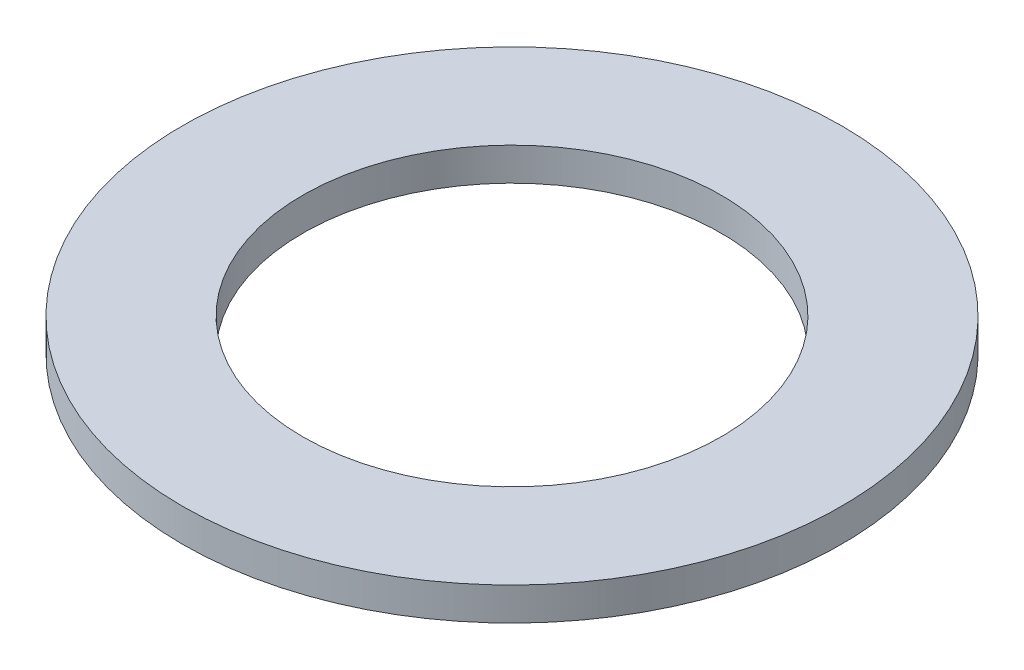
ISO-10303-21;
HEADER;
FILE_DESCRIPTION(('STEP AP214'),'2;1');
FILE_NAME('part.step','',(''),(''),'','','');
FILE_SCHEMA(('AUTOMOTIVE_DESIGN { 1 0 10303 214 1 1 1 1 }'));
ENDSEC;
DATA;
#1=APPLICATION_CONTEXT('core data for automotive mechanical design processes');
#2=APPLICATION_PROTOCOL_DEFINITION('international standard','automotive_design',2000,#1);
#3=PRODUCT_CONTEXT('',#1,'mechanical');
#4=PRODUCT('Part','Part','',(#3));
#5=PRODUCT_RELATED_PRODUCT_CATEGORY('part','',(#4));
#6=PRODUCT_DEFINITION_FORMATION('','',#4);
#7=PRODUCT_DEFINITION_CONTEXT('part definition',#1,'design');
#8=PRODUCT_DEFINITION('design','',#6,#7);
#9=PRODUCT_DEFINITION_SHAPE('','',#8);
#10=(LENGTH_UNIT() NAMED_UNIT(*) SI_UNIT(.MILLI.,.METRE.));
#11=(NAMED_UNIT(*) PLANE_ANGLE_UNIT() SI_UNIT($,.RADIAN.));
#12=(NAMED_UNIT(*) SI_UNIT($,.STERADIAN.) SOLID_ANGLE_UNIT());
#13=UNCERTAINTY_MEASURE_WITH_UNIT(LENGTH_MEASURE(1.E-05),#10,'distance_accuracy_value','');
#14=(GEOMETRIC_REPRESENTATION_CONTEXT(3) GLOBAL_UNCERTAINTY_ASSIGNED_CONTEXT((#13)) GLOBAL_UNIT_ASSIGNED_CONTEXT((#10,
#11,#12)) REPRESENTATION_CONTEXT('',''));
#15=CARTESIAN_POINT('',(0.,0.,0.));
#16=DIRECTION('',(0.,0.,1.));
#17=DIRECTION('',(1.,0.,0.));
#18=AXIS2_PLACEMENT_3D('',#15,#16,#17);
#19=CARTESIAN_POINT('',(0.,3.,0.));
#20=DIRECTION('',(0.,1.,0.));
#21=DIRECTION('',(0.,0.,1.));
#22=AXIS2_PLACEMENT_3D('',#19,#20,#21);
#23=PLANE('',#22);
#24=CARTESIAN_POINT('',(0.,3.,0.));
#25=DIRECTION('',(0.,1.,0.));
#26=DIRECTION('',(0.,0.,1.));
#27=AXIS2_PLACEMENT_3D('',#24,#25,#26);
#28=CIRCLE('',#27,30.);
#29=CARTESIAN_POINT('',(0.,3.,30.));
#30=VERTEX_POINT('',#29);
#31=EDGE_CURVE('E10',#30,#30,#28,.T.);
#32=ORIENTED_EDGE('',*,*,#31,.T.);
#33=EDGE_LOOP('',(#32));
#34=FACE_BOUND('',#33,.T.);
#35=CARTESIAN_POINT('',(0.,3.,0.));
#36=DIRECTION('',(0.,1.,0.));
#37=DIRECTION('',(0.,0.,1.));
#38=AXIS2_PLACEMENT_3D('',#35,#36,#37);
#39=CIRCLE('',#38,19.05);
#40=CARTESIAN_POINT('',(0.,3.,19.05));
#41=VERTEX_POINT('',#40);
#42=EDGE_CURVE('E46',#41,#41,#39,.T.);
#43=ORIENTED_EDGE('',*,*,#42,.F.);
#44=EDGE_LOOP('',(#43));
#45=FACE_BOUND('',#44,.T.);
#46=ADVANCED_FACE('F35',(#34,#45),#23,.T.);
#47=CARTESIAN_POINT('',(0.,0.,0.));
#48=DIRECTION('',(0.,1.,0.));
#49=DIRECTION('',(0.,0.,1.));
#50=AXIS2_PLACEMENT_3D('',#47,#48,#49);
#51=PLANE('',#50);
#52=CARTESIAN_POINT('',(0.,0.,0.));
#53=DIRECTION('',(0.,1.,0.));
#54=DIRECTION('',(0.,0.,1.));
#55=AXIS2_PLACEMENT_3D('',#52,#53,#54);
#56=CIRCLE('',#55,30.);
#57=CARTESIAN_POINT('',(0.,0.,30.));
#58=VERTEX_POINT('',#57);
#59=EDGE_CURVE('E39',#58,#58,#56,.T.);
#60=ORIENTED_EDGE('',*,*,#59,.F.);
#61=EDGE_LOOP('',(#60));
#62=FACE_BOUND('',#61,.T.);
#63=CARTESIAN_POINT('',(0.,0.,0.));
#64=DIRECTION('',(0.,1.,0.));
#65=DIRECTION('',(0.,0.,1.));
#66=AXIS2_PLACEMENT_3D('',#63,#64,#65);
#67=CIRCLE('',#66,19.05);
#68=CARTESIAN_POINT('',(0.,0.,19.05));
#69=VERTEX_POINT('',#68);
#70=EDGE_CURVE('E48',#69,#69,#67,.T.);
#71=ORIENTED_EDGE('',*,*,#70,.T.);
#72=EDGE_LOOP('',(#71));
#73=FACE_BOUND('',#72,.T.);
#74=ADVANCED_FACE('F58',(#62,#73),#51,.F.);
#75=CARTESIAN_POINT('',(0.,3.,0.));
#76=DIRECTION('',(0.,-1.,0.));
#77=DIRECTION('',(0.,0.,-1.));
#78=AXIS2_PLACEMENT_3D('',#75,#76,#77);
#79=CYLINDRICAL_SURFACE('',#78,30.);
#80=ORIENTED_EDGE('',*,*,#31,.F.);
#81=EDGE_LOOP('',(#80));
#82=FACE_BOUND('',#81,.T.);
#83=ORIENTED_EDGE('',*,*,#59,.T.);
#84=EDGE_LOOP('',(#83));
#85=FACE_BOUND('',#84,.T.);
#86=ADVANCED_FACE('F37',(#82,#85),#79,.T.);
#87=CARTESIAN_POINT('',(0.,3.,0.));
#88=DIRECTION('',(0.,-1.,0.));
#89=DIRECTION('',(0.,0.,-1.));
#90=AXIS2_PLACEMENT_3D('',#87,#88,#89);
#91=CYLINDRICAL_SURFACE('',#90,19.05);
#92=ORIENTED_EDGE('',*,*,#42,.T.);
#93=EDGE_LOOP('',(#92));
#94=FACE_BOUND('',#93,.T.);
#95=ORIENTED_EDGE('',*,*,#70,.F.);
#96=EDGE_LOOP('',(#95));
#97=FACE_BOUND('',#96,.T.);
#98=ADVANCED_FACE('F54',(#94,#97),#91,.F.);
#99=CLOSED_SHELL('',(#46,#74,#86,#98));
#100=MANIFOLD_SOLID_BREP('B2',#99);
#101=ADVANCED_BREP_SHAPE_REPRESENTATION('',(#18,#100),#14);
#102=SHAPE_DEFINITION_REPRESENTATION(#9,#101);
ENDSEC;
END-ISO-10303-21;
